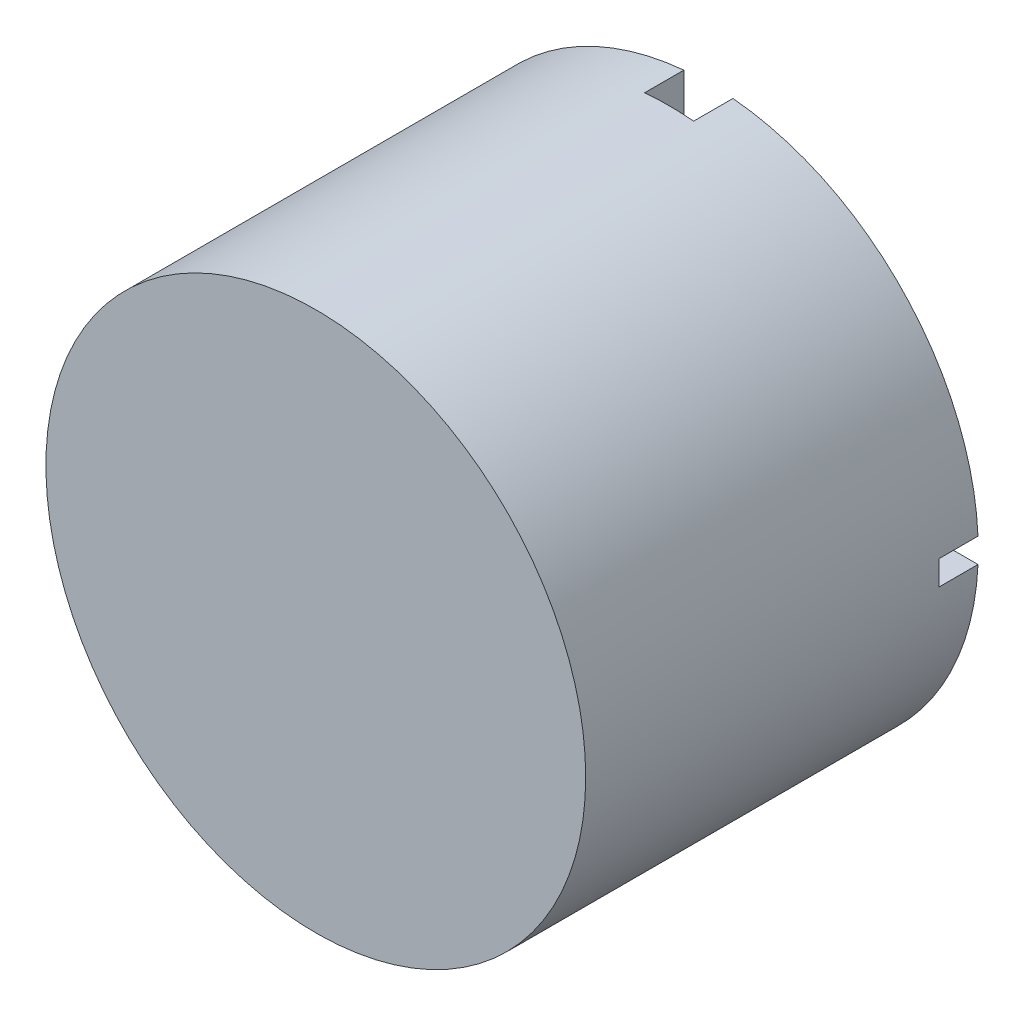
ISO-10303-21;
HEADER;
FILE_DESCRIPTION(('STEP AP214'),'2;1');
FILE_NAME('part.step','',(''),(''),'','','');
FILE_SCHEMA(('AUTOMOTIVE_DESIGN { 1 0 10303 214 1 1 1 1 }'));
ENDSEC;
DATA;
#1=APPLICATION_CONTEXT('core data for automotive mechanical design processes');
#2=APPLICATION_PROTOCOL_DEFINITION('international standard','automotive_design',2000,#1);
#3=PRODUCT_CONTEXT('',#1,'mechanical');
#4=PRODUCT('Part','Part','',(#3));
#5=PRODUCT_RELATED_PRODUCT_CATEGORY('part','',(#4));
#6=PRODUCT_DEFINITION_FORMATION('','',#4);
#7=PRODUCT_DEFINITION_CONTEXT('part definition',#1,'design');
#8=PRODUCT_DEFINITION('design','',#6,#7);
#9=PRODUCT_DEFINITION_SHAPE('','',#8);
#10=(LENGTH_UNIT() NAMED_UNIT(*) SI_UNIT(.MILLI.,.METRE.));
#11=(NAMED_UNIT(*) PLANE_ANGLE_UNIT() SI_UNIT($,.RADIAN.));
#12=(NAMED_UNIT(*) SI_UNIT($,.STERADIAN.) SOLID_ANGLE_UNIT());
#13=UNCERTAINTY_MEASURE_WITH_UNIT(LENGTH_MEASURE(1.E-05),#10,'distance_accuracy_value','');
#14=(GEOMETRIC_REPRESENTATION_CONTEXT(3) GLOBAL_UNCERTAINTY_ASSIGNED_CONTEXT((#13)) GLOBAL_UNIT_ASSIGNED_CONTEXT((#10,
#11,#12)) REPRESENTATION_CONTEXT('',''));
#15=CARTESIAN_POINT('',(0.,0.,0.));
#16=DIRECTION('',(0.,0.,1.));
#17=DIRECTION('',(1.,0.,0.));
#18=AXIS2_PLACEMENT_3D('',#15,#16,#17);
#19=CARTESIAN_POINT('',(0.,0.,0.));
#20=DIRECTION('',(0.,0.,1.));
#21=DIRECTION('',(1.,0.,0.));
#22=AXIS2_PLACEMENT_3D('',#19,#20,#21);
#23=PLANE('',#22);
#24=CARTESIAN_POINT('',(0.,0.,0.));
#25=DIRECTION('',(0.,0.,1.));
#26=DIRECTION('',(1.,0.,0.));
#27=AXIS2_PLACEMENT_3D('',#24,#25,#26);
#28=CIRCLE('',#27,17.4625);
#29=CARTESIAN_POINT('',(-1.5875,17.390191200789,0.));
#30=VERTEX_POINT('',#29);
#31=CARTESIAN_POINT('',(-17.4444508995697,0.793749999999999,0.));
#32=VERTEX_POINT('',#31);
#33=EDGE_CURVE('E197',#30,#32,#28,.T.);
#34=ORIENTED_EDGE('',*,*,#33,.F.);
#35=DIRECTION('',(0.,1.,0.));
#36=VECTOR('',#35,1.);
#37=CARTESIAN_POINT('',(-1.5875,20.5821454898825,0.));
#38=LINE('',#37,#36);
#39=CARTESIAN_POINT('',(-1.5875,0.793749999999998,0.));
#40=VERTEX_POINT('',#39);
#41=EDGE_CURVE('E127',#40,#30,#38,.T.);
#42=ORIENTED_EDGE('',*,*,#41,.F.);
#43=DIRECTION('',(-1.,0.,0.));
#44=VECTOR('',#43,1.);
#45=CARTESIAN_POINT('',(0.,0.793749999999998,0.));
#46=LINE('',#45,#44);
#47=EDGE_CURVE('E204',#40,#32,#46,.T.);
#48=ORIENTED_EDGE('',*,*,#47,.T.);
#49=EDGE_LOOP('',(#34,#42,#48));
#50=FACE_BOUND('',#49,.T.);
#51=ADVANCED_FACE('F33',(#50),#23,.F.);
#52=CARTESIAN_POINT('',(-17.4444508995697,-0.793750000000001,0.));
#53=VERTEX_POINT('',#52);
#54=CARTESIAN_POINT('',(-1.5875,-17.390191200789,0.));
#55=VERTEX_POINT('',#54);
#56=EDGE_CURVE('E226',#53,#55,#28,.T.);
#57=ORIENTED_EDGE('',*,*,#56,.F.);
#58=DIRECTION('',(-1.,0.,0.));
#59=VECTOR('',#58,1.);
#60=CARTESIAN_POINT('',(-1.5875,-0.793750000000004,0.));
#61=LINE('',#60,#59);
#62=CARTESIAN_POINT('',(-1.5875,-0.793750000000004,0.));
#63=VERTEX_POINT('',#62);
#64=EDGE_CURVE('E158',#63,#53,#61,.T.);
#65=ORIENTED_EDGE('',*,*,#64,.F.);
#66=DIRECTION('',(0.,-1.,0.));
#67=VECTOR('',#66,1.);
#68=CARTESIAN_POINT('',(-1.5875,0.,0.));
#69=LINE('',#68,#67);
#70=EDGE_CURVE('E202',#63,#55,#69,.T.);
#71=ORIENTED_EDGE('',*,*,#70,.T.);
#72=EDGE_LOOP('',(#57,#65,#71));
#73=FACE_BOUND('',#72,.T.);
#74=ADVANCED_FACE('F251',(#73),#23,.F.);
#75=CARTESIAN_POINT('',(1.5875,-17.390191200789,0.));
#76=VERTEX_POINT('',#75);
#77=CARTESIAN_POINT('',(17.4444508995697,-0.79375,0.));
#78=VERTEX_POINT('',#77);
#79=EDGE_CURVE('E190',#76,#78,#28,.T.);
#80=ORIENTED_EDGE('',*,*,#79,.F.);
#81=DIRECTION('',(0.,-1.,0.));
#82=VECTOR('',#81,1.);
#83=CARTESIAN_POINT('',(1.5875,-0.79375,0.));
#84=LINE('',#83,#82);
#85=CARTESIAN_POINT('',(1.5875,-0.79375,0.));
#86=VERTEX_POINT('',#85);
#87=EDGE_CURVE('E156',#86,#76,#84,.T.);
#88=ORIENTED_EDGE('',*,*,#87,.F.);
#89=DIRECTION('',(1.,0.,0.));
#90=VECTOR('',#89,1.);
#91=CARTESIAN_POINT('',(0.,-0.79375,0.));
#92=LINE('',#91,#90);
#93=EDGE_CURVE('E199',#86,#78,#92,.T.);
#94=ORIENTED_EDGE('',*,*,#93,.T.);
#95=EDGE_LOOP('',(#80,#88,#94));
#96=FACE_BOUND('',#95,.T.);
#97=ADVANCED_FACE('F240',(#96),#23,.F.);
#98=CARTESIAN_POINT('',(0.,0.,25.4));
#99=DIRECTION('',(0.,0.,-1.));
#100=DIRECTION('',(-1.,0.,0.));
#101=AXIS2_PLACEMENT_3D('',#98,#99,#100);
#102=CYLINDRICAL_SURFACE('',#101,17.4625);
#103=CARTESIAN_POINT('',(17.4444508995697,0.79375,0.));
#104=VERTEX_POINT('',#103);
#105=CARTESIAN_POINT('',(1.5875,17.390191200789,0.));
#106=VERTEX_POINT('',#105);
#107=EDGE_CURVE('E194',#104,#106,#28,.T.);
#108=ORIENTED_EDGE('',*,*,#107,.T.);
#109=DIRECTION('',(0.,0.,-1.));
#110=VECTOR('',#109,1.);
#111=CARTESIAN_POINT('',(1.5875,17.390191200789,25.4));
#112=LINE('',#111,#110);
#113=CARTESIAN_POINT('',(1.5875,17.390191200789,2.54));
#114=VERTEX_POINT('',#113);
#115=EDGE_CURVE('E188',#106,#114,#112,.F.);
#116=ORIENTED_EDGE('',*,*,#115,.T.);
#117=CARTESIAN_POINT('',(0.,0.,2.54));
#118=DIRECTION('',(0.,0.,-1.));
#119=DIRECTION('',(-1.,0.,0.));
#120=AXIS2_PLACEMENT_3D('',#117,#118,#119);
#121=CIRCLE('',#120,17.4625);
#122=CARTESIAN_POINT('',(-1.5875,17.390191200789,2.54));
#123=VERTEX_POINT('',#122);
#124=EDGE_CURVE('E11',#123,#114,#121,.T.);
#125=ORIENTED_EDGE('',*,*,#124,.F.);
#126=DIRECTION('',(0.,0.,-1.));
#127=VECTOR('',#126,1.);
#128=CARTESIAN_POINT('',(-1.5875,17.390191200789,25.4));
#129=LINE('',#128,#127);
#130=EDGE_CURVE('E185',#123,#30,#129,.T.);
#131=ORIENTED_EDGE('',*,*,#130,.T.);
#132=ORIENTED_EDGE('',*,*,#33,.T.);
#133=DIRECTION('',(0.,0.,-1.));
#134=VECTOR('',#133,1.);
#135=CARTESIAN_POINT('',(-17.4444508995697,0.793749999999999,25.4));
#136=LINE('',#135,#134);
#137=CARTESIAN_POINT('',(-17.4444508995697,0.793749999999999,2.54));
#138=VERTEX_POINT('',#137);
#139=EDGE_CURVE('E182',#32,#138,#136,.F.);
#140=ORIENTED_EDGE('',*,*,#139,.T.);
#141=CARTESIAN_POINT('',(-17.4444508995697,-0.793750000000001,2.54));
#142=VERTEX_POINT('',#141);
#143=EDGE_CURVE('E37',#142,#138,#121,.T.);
#144=ORIENTED_EDGE('',*,*,#143,.F.);
#145=DIRECTION('',(0.,0.,-1.));
#146=VECTOR('',#145,1.);
#147=CARTESIAN_POINT('',(-17.4444508995697,-0.793750000000001,25.4));
#148=LINE('',#147,#146);
#149=EDGE_CURVE('E179',#142,#53,#148,.T.);
#150=ORIENTED_EDGE('',*,*,#149,.T.);
#151=ORIENTED_EDGE('',*,*,#56,.T.);
#152=DIRECTION('',(0.,0.,-1.));
#153=VECTOR('',#152,1.);
#154=CARTESIAN_POINT('',(-1.5875,-17.390191200789,25.4));
#155=LINE('',#154,#153);
#156=CARTESIAN_POINT('',(-1.5875,-17.390191200789,2.54));
#157=VERTEX_POINT('',#156);
#158=EDGE_CURVE('E176',#55,#157,#155,.F.);
#159=ORIENTED_EDGE('',*,*,#158,.T.);
#160=CARTESIAN_POINT('',(1.5875,-17.390191200789,2.54));
#161=VERTEX_POINT('',#160);
#162=EDGE_CURVE('E210',#161,#157,#121,.T.);
#163=ORIENTED_EDGE('',*,*,#162,.F.);
#164=DIRECTION('',(0.,0.,-1.));
#165=VECTOR('',#164,1.);
#166=CARTESIAN_POINT('',(1.5875,-17.390191200789,25.4));
#167=LINE('',#166,#165);
#168=EDGE_CURVE('E173',#161,#76,#167,.T.);
#169=ORIENTED_EDGE('',*,*,#168,.T.);
#170=ORIENTED_EDGE('',*,*,#79,.T.);
#171=DIRECTION('',(0.,0.,-1.));
#172=VECTOR('',#171,1.);
#173=CARTESIAN_POINT('',(17.4444508995697,-0.79375,25.4));
#174=LINE('',#173,#172);
#175=CARTESIAN_POINT('',(17.4444508995697,-0.79375,2.54));
#176=VERTEX_POINT('',#175);
#177=EDGE_CURVE('E170',#78,#176,#174,.F.);
#178=ORIENTED_EDGE('',*,*,#177,.T.);
#179=CARTESIAN_POINT('',(17.4444508995697,0.79375,2.54));
#180=VERTEX_POINT('',#179);
#181=EDGE_CURVE('E42',#180,#176,#121,.T.);
#182=ORIENTED_EDGE('',*,*,#181,.F.);
#183=DIRECTION('',(0.,0.,-1.));
#184=VECTOR('',#183,1.);
#185=CARTESIAN_POINT('',(17.4444508995697,0.79375,25.4));
#186=LINE('',#185,#184);
#187=EDGE_CURVE('E138',#180,#104,#186,.T.);
#188=ORIENTED_EDGE('',*,*,#187,.T.);
#189=EDGE_LOOP('',(#108,#116,#125,#131,#132,#140,#144,#150,#151,#159,#163,#169,#170,#178,#182,#188));
#190=FACE_BOUND('',#189,.T.);
#191=CARTESIAN_POINT('',(0.,0.,25.4));
#192=DIRECTION('',(0.,0.,1.));
#193=DIRECTION('',(1.,0.,0.));
#194=AXIS2_PLACEMENT_3D('',#191,#192,#193);
#195=CIRCLE('',#194,17.4625);
#196=CARTESIAN_POINT('',(17.4625,0.,25.4));
#197=VERTEX_POINT('',#196);
#198=EDGE_CURVE('E191',#197,#197,#195,.T.);
#199=ORIENTED_EDGE('',*,*,#198,.F.);
#200=EDGE_LOOP('',(#199));
#201=FACE_BOUND('',#200,.T.);
#202=ADVANCED_FACE('F35',(#190,#201),#102,.T.);
#203=CARTESIAN_POINT('',(0.,0.,25.4));
#204=DIRECTION('',(0.,0.,1.));
#205=DIRECTION('',(1.,0.,0.));
#206=AXIS2_PLACEMENT_3D('',#203,#204,#205);
#207=PLANE('',#206);
#208=ORIENTED_EDGE('',*,*,#198,.T.);
#209=EDGE_LOOP('',(#208));
#210=FACE_BOUND('',#209,.T.);
#211=ADVANCED_FACE('F239',(#210),#207,.T.);
#212=DIRECTION('',(1.,0.,0.));
#213=VECTOR('',#212,1.);
#214=CARTESIAN_POINT('',(24.3561350073591,0.79375,0.));
#215=LINE('',#214,#213);
#216=CARTESIAN_POINT('',(1.5875,0.793749999999999,0.));
#217=VERTEX_POINT('',#216);
#218=EDGE_CURVE('E154',#217,#104,#215,.T.);
#219=ORIENTED_EDGE('',*,*,#218,.F.);
#220=DIRECTION('',(0.,1.,0.));
#221=VECTOR('',#220,1.);
#222=CARTESIAN_POINT('',(1.5875,0.,0.));
#223=LINE('',#222,#221);
#224=EDGE_CURVE('E131',#217,#106,#223,.T.);
#225=ORIENTED_EDGE('',*,*,#224,.T.);
#226=ORIENTED_EDGE('',*,*,#107,.F.);
#227=EDGE_LOOP('',(#219,#225,#226));
#228=FACE_BOUND('',#227,.T.);
#229=ADVANCED_FACE('F237',(#228),#23,.F.);
#230=CARTESIAN_POINT('',(0.,0.,2.54));
#231=DIRECTION('',(0.,0.,-1.));
#232=DIRECTION('',(-1.,0.,0.));
#233=AXIS2_PLACEMENT_3D('',#230,#231,#232);
#234=PLANE('',#233);
#235=ORIENTED_EDGE('',*,*,#124,.T.);
#236=DIRECTION('',(0.,-1.,0.));
#237=VECTOR('',#236,1.);
#238=CARTESIAN_POINT('',(1.5875,20.5821454898825,2.54));
#239=LINE('',#238,#237);
#240=CARTESIAN_POINT('',(1.5875,0.793749999999999,2.54));
#241=VERTEX_POINT('',#240);
#242=EDGE_CURVE('E121',#114,#241,#239,.T.);
#243=ORIENTED_EDGE('',*,*,#242,.T.);
#244=DIRECTION('',(1.,0.,0.));
#245=VECTOR('',#244,1.);
#246=CARTESIAN_POINT('',(24.3561350073591,0.79375,2.54));
#247=LINE('',#246,#245);
#248=EDGE_CURVE('E123',#241,#180,#247,.T.);
#249=ORIENTED_EDGE('',*,*,#248,.T.);
#250=ORIENTED_EDGE('',*,*,#181,.T.);
#251=DIRECTION('',(-1.,0.,0.));
#252=VECTOR('',#251,1.);
#253=CARTESIAN_POINT('',(24.3561350073591,-0.79375,2.54));
#254=LINE('',#253,#252);
#255=CARTESIAN_POINT('',(1.5875,-0.79375,2.54));
#256=VERTEX_POINT('',#255);
#257=EDGE_CURVE('E139',#176,#256,#254,.T.);
#258=ORIENTED_EDGE('',*,*,#257,.T.);
#259=DIRECTION('',(0.,-1.,0.));
#260=VECTOR('',#259,1.);
#261=CARTESIAN_POINT('',(1.5875,-0.79375,2.54));
#262=LINE('',#261,#260);
#263=EDGE_CURVE('E141',#256,#161,#262,.T.);
#264=ORIENTED_EDGE('',*,*,#263,.T.);
#265=ORIENTED_EDGE('',*,*,#162,.T.);
#266=DIRECTION('',(0.,1.,0.));
#267=VECTOR('',#266,1.);
#268=CARTESIAN_POINT('',(-1.5875,-0.793750000000004,2.54));
#269=LINE('',#268,#267);
#270=CARTESIAN_POINT('',(-1.5875,-0.793750000000004,2.54));
#271=VERTEX_POINT('',#270);
#272=EDGE_CURVE('E146',#157,#271,#269,.T.);
#273=ORIENTED_EDGE('',*,*,#272,.T.);
#274=DIRECTION('',(-1.,0.,0.));
#275=VECTOR('',#274,1.);
#276=CARTESIAN_POINT('',(-1.5875,-0.793750000000004,2.54));
#277=LINE('',#276,#275);
#278=EDGE_CURVE('E148',#271,#142,#277,.T.);
#279=ORIENTED_EDGE('',*,*,#278,.T.);
#280=ORIENTED_EDGE('',*,*,#143,.T.);
#281=DIRECTION('',(1.,0.,0.));
#282=VECTOR('',#281,1.);
#283=CARTESIAN_POINT('',(-1.5875,0.793749999999998,2.54));
#284=LINE('',#283,#282);
#285=CARTESIAN_POINT('',(-1.5875,0.793749999999998,2.54));
#286=VERTEX_POINT('',#285);
#287=EDGE_CURVE('E151',#138,#286,#284,.T.);
#288=ORIENTED_EDGE('',*,*,#287,.T.);
#289=DIRECTION('',(0.,1.,0.));
#290=VECTOR('',#289,1.);
#291=CARTESIAN_POINT('',(-1.5875,20.5821454898825,2.54));
#292=LINE('',#291,#290);
#293=EDGE_CURVE('E134',#286,#123,#292,.T.);
#294=ORIENTED_EDGE('',*,*,#293,.T.);
#295=EDGE_LOOP('',(#235,#243,#249,#250,#258,#264,#265,#273,#279,#280,#288,#294));
#296=FACE_BOUND('',#295,.T.);
#297=ADVANCED_FACE('F122',(#296),#234,.T.);
#298=CARTESIAN_POINT('',(1.5875,20.5821454898825,2.54));
#299=DIRECTION('',(1.,0.,0.));
#300=DIRECTION('',(0.,1.,0.));
#301=AXIS2_PLACEMENT_3D('',#298,#299,#300);
#302=PLANE('',#301);
#303=ORIENTED_EDGE('',*,*,#224,.F.);
#304=DIRECTION('',(0.,0.,-1.));
#305=VECTOR('',#304,1.);
#306=CARTESIAN_POINT('',(1.5875,0.793749999999999,2.54));
#307=LINE('',#306,#305);
#308=EDGE_CURVE('E49',#241,#217,#307,.T.);
#309=ORIENTED_EDGE('',*,*,#308,.F.);
#310=ORIENTED_EDGE('',*,*,#242,.F.);
#311=ORIENTED_EDGE('',*,*,#115,.F.);
#312=EDGE_LOOP('',(#303,#309,#310,#311));
#313=FACE_BOUND('',#312,.T.);
#314=ADVANCED_FACE('F129',(#313),#302,.F.);
#315=CARTESIAN_POINT('',(-1.5875,20.5821454898825,2.54));
#316=DIRECTION('',(-1.,0.,0.));
#317=DIRECTION('',(0.,-1.,0.));
#318=AXIS2_PLACEMENT_3D('',#315,#316,#317);
#319=PLANE('',#318);
#320=ORIENTED_EDGE('',*,*,#293,.F.);
#321=DIRECTION('',(0.,0.,-1.));
#322=VECTOR('',#321,1.);
#323=CARTESIAN_POINT('',(-1.5875,0.793749999999998,2.54));
#324=LINE('',#323,#322);
#325=EDGE_CURVE('E161',#286,#40,#324,.T.);
#326=ORIENTED_EDGE('',*,*,#325,.T.);
#327=ORIENTED_EDGE('',*,*,#41,.T.);
#328=ORIENTED_EDGE('',*,*,#130,.F.);
#329=EDGE_LOOP('',(#320,#326,#327,#328));
#330=FACE_BOUND('',#329,.T.);
#331=ADVANCED_FACE('F231',(#330),#319,.F.);
#332=CARTESIAN_POINT('',(-1.5875,0.793749999999998,2.54));
#333=DIRECTION('',(0.,1.,0.));
#334=DIRECTION('',(-1.,0.,0.));
#335=AXIS2_PLACEMENT_3D('',#332,#333,#334);
#336=PLANE('',#335);
#337=ORIENTED_EDGE('',*,*,#47,.F.);
#338=ORIENTED_EDGE('',*,*,#325,.F.);
#339=ORIENTED_EDGE('',*,*,#287,.F.);
#340=ORIENTED_EDGE('',*,*,#139,.F.);
#341=EDGE_LOOP('',(#337,#338,#339,#340));
#342=FACE_BOUND('',#341,.T.);
#343=ADVANCED_FACE('F234',(#342),#336,.F.);
#344=CARTESIAN_POINT('',(-1.5875,-0.793750000000004,2.54));
#345=DIRECTION('',(0.,-1.,0.));
#346=DIRECTION('',(1.,0.,0.));
#347=AXIS2_PLACEMENT_3D('',#344,#345,#346);
#348=PLANE('',#347);
#349=ORIENTED_EDGE('',*,*,#278,.F.);
#350=DIRECTION('',(0.,0.,-1.));
#351=VECTOR('',#350,1.);
#352=CARTESIAN_POINT('',(-1.5875,-0.793750000000004,2.54));
#353=LINE('',#352,#351);
#354=EDGE_CURVE('E164',#271,#63,#353,.T.);
#355=ORIENTED_EDGE('',*,*,#354,.T.);
#356=ORIENTED_EDGE('',*,*,#64,.T.);
#357=ORIENTED_EDGE('',*,*,#149,.F.);
#358=EDGE_LOOP('',(#349,#355,#356,#357));
#359=FACE_BOUND('',#358,.T.);
#360=ADVANCED_FACE('F265',(#359),#348,.F.);
#361=CARTESIAN_POINT('',(-1.5875,-0.793750000000004,2.54));
#362=DIRECTION('',(-1.,0.,0.));
#363=DIRECTION('',(0.,-1.,0.));
#364=AXIS2_PLACEMENT_3D('',#361,#362,#363);
#365=PLANE('',#364);
#366=ORIENTED_EDGE('',*,*,#70,.F.);
#367=ORIENTED_EDGE('',*,*,#354,.F.);
#368=ORIENTED_EDGE('',*,*,#272,.F.);
#369=ORIENTED_EDGE('',*,*,#158,.F.);
#370=EDGE_LOOP('',(#366,#367,#368,#369));
#371=FACE_BOUND('',#370,.T.);
#372=ADVANCED_FACE('F262',(#371),#365,.F.);
#373=CARTESIAN_POINT('',(1.5875,-0.79375,2.54));
#374=DIRECTION('',(1.,0.,0.));
#375=DIRECTION('',(0.,1.,0.));
#376=AXIS2_PLACEMENT_3D('',#373,#374,#375);
#377=PLANE('',#376);
#378=ORIENTED_EDGE('',*,*,#263,.F.);
#379=DIRECTION('',(0.,0.,-1.));
#380=VECTOR('',#379,1.);
#381=CARTESIAN_POINT('',(1.5875,-0.79375,2.54));
#382=LINE('',#381,#380);
#383=EDGE_CURVE('E133',#256,#86,#382,.T.);
#384=ORIENTED_EDGE('',*,*,#383,.T.);
#385=ORIENTED_EDGE('',*,*,#87,.T.);
#386=ORIENTED_EDGE('',*,*,#168,.F.);
#387=EDGE_LOOP('',(#378,#384,#385,#386));
#388=FACE_BOUND('',#387,.T.);
#389=ADVANCED_FACE('F272',(#388),#377,.F.);
#390=CARTESIAN_POINT('',(24.3561350073591,-0.79375,2.54));
#391=DIRECTION('',(0.,-1.,0.));
#392=DIRECTION('',(1.,0.,0.));
#393=AXIS2_PLACEMENT_3D('',#390,#391,#392);
#394=PLANE('',#393);
#395=ORIENTED_EDGE('',*,*,#93,.F.);
#396=ORIENTED_EDGE('',*,*,#383,.F.);
#397=ORIENTED_EDGE('',*,*,#257,.F.);
#398=ORIENTED_EDGE('',*,*,#177,.F.);
#399=EDGE_LOOP('',(#395,#396,#397,#398));
#400=FACE_BOUND('',#399,.T.);
#401=ADVANCED_FACE('F219',(#400),#394,.F.);
#402=CARTESIAN_POINT('',(24.3561350073591,0.79375,2.54));
#403=DIRECTION('',(0.,1.,0.));
#404=DIRECTION('',(-1.,0.,0.));
#405=AXIS2_PLACEMENT_3D('',#402,#403,#404);
#406=PLANE('',#405);
#407=ORIENTED_EDGE('',*,*,#248,.F.);
#408=ORIENTED_EDGE('',*,*,#308,.T.);
#409=ORIENTED_EDGE('',*,*,#218,.T.);
#410=ORIENTED_EDGE('',*,*,#187,.F.);
#411=EDGE_LOOP('',(#407,#408,#409,#410));
#412=FACE_BOUND('',#411,.T.);
#413=ADVANCED_FACE('F136',(#412),#406,.F.);
#414=CLOSED_SHELL('',(#51,#74,#97,#202,#211,#229,#297,#314,#331,#343,#360,#372,#389,#401,#413));
#415=MANIFOLD_SOLID_BREP('B2',#414);
#416=ADVANCED_BREP_SHAPE_REPRESENTATION('',(#18,#415),#14);
#417=SHAPE_DEFINITION_REPRESENTATION(#9,#416);
ENDSEC;
END-ISO-10303-21;
